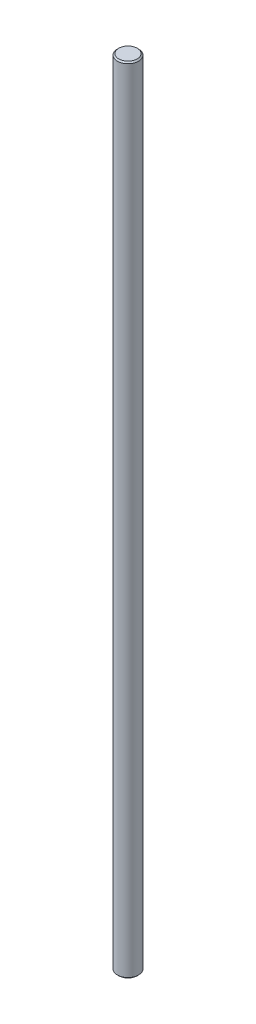
ISO-10303-21;
HEADER;
FILE_DESCRIPTION(('STEP AP214'),'2;1');
FILE_NAME('part.step','',(''),(''),'','','');
FILE_SCHEMA(('AUTOMOTIVE_DESIGN { 1 0 10303 214 1 1 1 1 }'));
ENDSEC;
DATA;
#1=APPLICATION_CONTEXT('core data for automotive mechanical design processes');
#2=APPLICATION_PROTOCOL_DEFINITION('international standard','automotive_design',2000,#1);
#3=PRODUCT_CONTEXT('',#1,'mechanical');
#4=PRODUCT('Part','Part','',(#3));
#5=PRODUCT_RELATED_PRODUCT_CATEGORY('part','',(#4));
#6=PRODUCT_DEFINITION_FORMATION('','',#4);
#7=PRODUCT_DEFINITION_CONTEXT('part definition',#1,'design');
#8=PRODUCT_DEFINITION('design','',#6,#7);
#9=PRODUCT_DEFINITION_SHAPE('','',#8);
#10=(LENGTH_UNIT() NAMED_UNIT(*) SI_UNIT(.MILLI.,.METRE.));
#11=(NAMED_UNIT(*) PLANE_ANGLE_UNIT() SI_UNIT($,.RADIAN.));
#12=(NAMED_UNIT(*) SI_UNIT($,.STERADIAN.) SOLID_ANGLE_UNIT());
#13=UNCERTAINTY_MEASURE_WITH_UNIT(LENGTH_MEASURE(1.E-05),#10,'distance_accuracy_value','');
#14=(GEOMETRIC_REPRESENTATION_CONTEXT(3) GLOBAL_UNCERTAINTY_ASSIGNED_CONTEXT((#13)) GLOBAL_UNIT_ASSIGNED_CONTEXT((#10,
#11,#12)) REPRESENTATION_CONTEXT('',''));
#15=CARTESIAN_POINT('',(0.,0.,0.));
#16=DIRECTION('',(0.,0.,1.));
#17=DIRECTION('',(1.,0.,0.));
#18=AXIS2_PLACEMENT_3D('',#15,#16,#17);
#19=CARTESIAN_POINT('',(0.,300.,0.));
#20=DIRECTION('',(0.,-1.,0.));
#21=DIRECTION('',(0.,0.,-1.));
#22=AXIS2_PLACEMENT_3D('',#19,#20,#21);
#23=CYLINDRICAL_SURFACE('',#22,4.);
#24=CARTESIAN_POINT('',(0.,0.499999999999889,0.));
#25=DIRECTION('',(0.,1.,0.));
#26=DIRECTION('',(0.,0.,1.));
#27=AXIS2_PLACEMENT_3D('',#24,#25,#26);
#28=CIRCLE('',#27,4.);
#29=CARTESIAN_POINT('',(0.,0.499999999999889,4.));
#30=VERTEX_POINT('',#29);
#31=EDGE_CURVE('E45',#30,#30,#28,.T.);
#32=ORIENTED_EDGE('',*,*,#31,.T.);
#33=EDGE_LOOP('',(#32));
#34=FACE_BOUND('',#33,.T.);
#35=CARTESIAN_POINT('',(0.,299.5,0.));
#36=DIRECTION('',(0.,1.,0.));
#37=DIRECTION('',(0.,0.,1.));
#38=AXIS2_PLACEMENT_3D('',#35,#36,#37);
#39=CIRCLE('',#38,4.);
#40=CARTESIAN_POINT('',(0.,299.5,4.));
#41=VERTEX_POINT('',#40);
#42=EDGE_CURVE('E49',#41,#41,#39,.F.);
#43=ORIENTED_EDGE('',*,*,#42,.T.);
#44=EDGE_LOOP('',(#43));
#45=FACE_BOUND('',#44,.T.);
#46=ADVANCED_FACE('F33',(#34,#45),#23,.T.);
#47=CARTESIAN_POINT('',(0.,300.,0.));
#48=DIRECTION('',(0.,1.,0.));
#49=DIRECTION('',(0.,0.,1.));
#50=AXIS2_PLACEMENT_3D('',#47,#48,#49);
#51=PLANE('',#50);
#52=CARTESIAN_POINT('',(0.,300.,0.));
#53=DIRECTION('',(0.,1.,0.));
#54=DIRECTION('',(0.,0.,1.));
#55=AXIS2_PLACEMENT_3D('',#52,#53,#54);
#56=CIRCLE('',#55,3.49999999999998);
#57=CARTESIAN_POINT('',(0.,300.,3.49999999999998));
#58=VERTEX_POINT('',#57);
#59=EDGE_CURVE('E10',#58,#58,#56,.T.);
#60=ORIENTED_EDGE('',*,*,#59,.T.);
#61=EDGE_LOOP('',(#60));
#62=FACE_BOUND('',#61,.T.);
#63=ADVANCED_FACE('F65',(#62),#51,.T.);
#64=CARTESIAN_POINT('',(0.,0.,0.));
#65=DIRECTION('',(0.,1.,0.));
#66=DIRECTION('',(0.,0.,1.));
#67=AXIS2_PLACEMENT_3D('',#64,#65,#66);
#68=PLANE('',#67);
#69=CARTESIAN_POINT('',(0.,0.,0.));
#70=DIRECTION('',(0.,1.,0.));
#71=DIRECTION('',(0.,0.,1.));
#72=AXIS2_PLACEMENT_3D('',#69,#70,#71);
#73=CIRCLE('',#72,3.50000000000009);
#74=CARTESIAN_POINT('',(0.,0.,3.50000000000009));
#75=VERTEX_POINT('',#74);
#76=EDGE_CURVE('E41',#75,#75,#73,.F.);
#77=ORIENTED_EDGE('',*,*,#76,.T.);
#78=EDGE_LOOP('',(#77));
#79=FACE_BOUND('',#78,.T.);
#80=ADVANCED_FACE('F62',(#79),#68,.F.);
#81=CARTESIAN_POINT('',(0.,0.499999999999889,0.));
#82=DIRECTION('',(0.,1.,0.));
#83=DIRECTION('',(0.,0.,1.));
#84=AXIS2_PLACEMENT_3D('',#81,#82,#83);
#85=CONICAL_SURFACE('',#84,4.,0.785398163397473);
#86=ORIENTED_EDGE('',*,*,#76,.F.);
#87=EDGE_LOOP('',(#86));
#88=FACE_BOUND('',#87,.T.);
#89=ORIENTED_EDGE('',*,*,#31,.F.);
#90=EDGE_LOOP('',(#89));
#91=FACE_BOUND('',#90,.T.);
#92=ADVANCED_FACE('F58',(#88,#91),#85,.T.);
#93=CARTESIAN_POINT('',(0.,300.,0.));
#94=DIRECTION('',(0.,-1.,0.));
#95=DIRECTION('',(0.,0.,-1.));
#96=AXIS2_PLACEMENT_3D('',#93,#94,#95);
#97=CONICAL_SURFACE('',#96,3.49999999999998,0.785398163397473);
#98=ORIENTED_EDGE('',*,*,#42,.F.);
#99=EDGE_LOOP('',(#98));
#100=FACE_BOUND('',#99,.T.);
#101=ORIENTED_EDGE('',*,*,#59,.F.);
#102=EDGE_LOOP('',(#101));
#103=FACE_BOUND('',#102,.T.);
#104=ADVANCED_FACE('F36',(#100,#103),#97,.T.);
#105=CLOSED_SHELL('',(#46,#63,#80,#92,#104));
#106=MANIFOLD_SOLID_BREP('B2',#105);
#107=ADVANCED_BREP_SHAPE_REPRESENTATION('',(#18,#106),#14);
#108=SHAPE_DEFINITION_REPRESENTATION(#9,#107);
ENDSEC;
END-ISO-10303-21;
